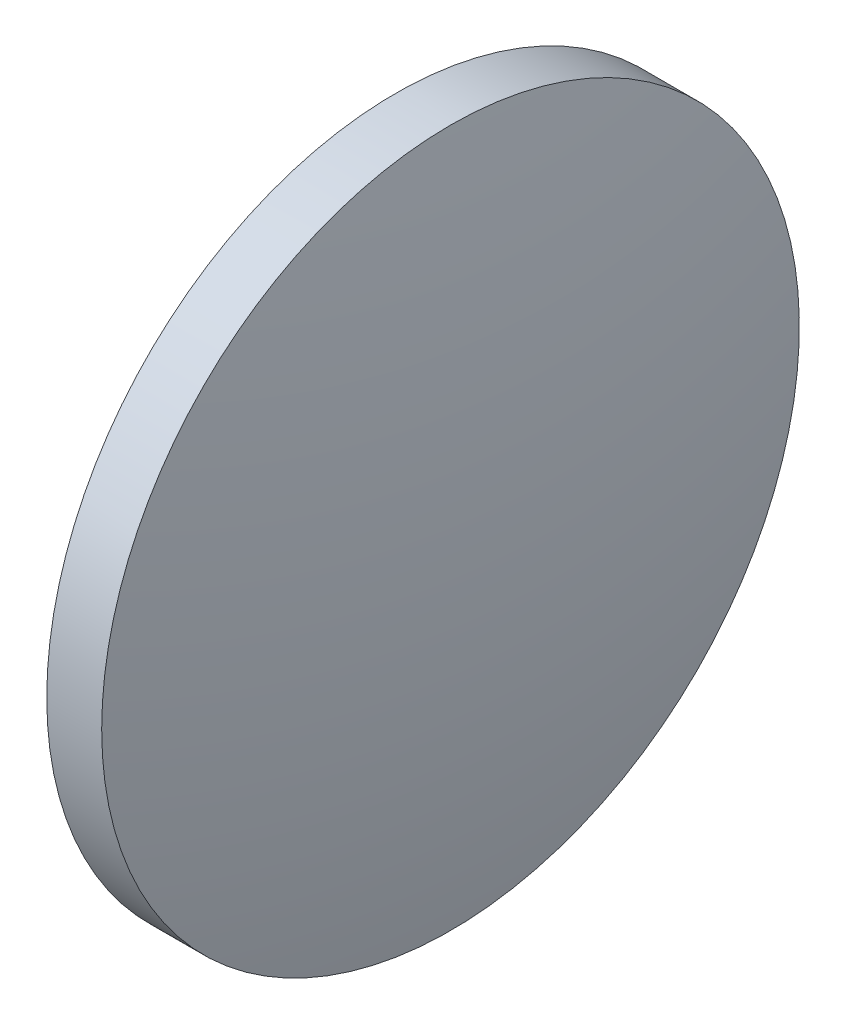
ISO-10303-21;
HEADER;
FILE_DESCRIPTION(('STEP AP214'),'2;1');
FILE_NAME('part.step','',(''),(''),'','','');
FILE_SCHEMA(('AUTOMOTIVE_DESIGN { 1 0 10303 214 1 1 1 1 }'));
ENDSEC;
DATA;
#1=APPLICATION_CONTEXT('core data for automotive mechanical design processes');
#2=APPLICATION_PROTOCOL_DEFINITION('international standard','automotive_design',2000,#1);
#3=PRODUCT_CONTEXT('',#1,'mechanical');
#4=PRODUCT('Part','Part','',(#3));
#5=PRODUCT_RELATED_PRODUCT_CATEGORY('part','',(#4));
#6=PRODUCT_DEFINITION_FORMATION('','',#4);
#7=PRODUCT_DEFINITION_CONTEXT('part definition',#1,'design');
#8=PRODUCT_DEFINITION('design','',#6,#7);
#9=PRODUCT_DEFINITION_SHAPE('','',#8);
#10=(LENGTH_UNIT() NAMED_UNIT(*) SI_UNIT(.MILLI.,.METRE.));
#11=(NAMED_UNIT(*) PLANE_ANGLE_UNIT() SI_UNIT($,.RADIAN.));
#12=(NAMED_UNIT(*) SI_UNIT($,.STERADIAN.) SOLID_ANGLE_UNIT());
#13=UNCERTAINTY_MEASURE_WITH_UNIT(LENGTH_MEASURE(1.E-05),#10,'distance_accuracy_value','');
#14=(GEOMETRIC_REPRESENTATION_CONTEXT(3) GLOBAL_UNCERTAINTY_ASSIGNED_CONTEXT((#13)) GLOBAL_UNIT_ASSIGNED_CONTEXT((#10,
#11,#12)) REPRESENTATION_CONTEXT('',''));
#15=CARTESIAN_POINT('',(0.,0.,0.));
#16=DIRECTION('',(0.,0.,1.));
#17=DIRECTION('',(1.,0.,0.));
#18=AXIS2_PLACEMENT_3D('',#15,#16,#17);
#19=CARTESIAN_POINT('',(330.483433764342,40.4416634295603,0.));
#20=DIRECTION('',(-1.,0.,0.));
#21=DIRECTION('',(0.,1.,0.));
#22=AXIS2_PLACEMENT_3D('',#19,#20,#21);
#23=SPHERICAL_SURFACE('',#22,62.6846153846156);
#24=CARTESIAN_POINT('',(391.868049148957,40.4416634295605,0.));
#25=DIRECTION('',(-1.,0.,0.));
#26=DIRECTION('',(0.,0.,1.));
#27=AXIS2_PLACEMENT_3D('',#24,#25,#26);
#28=CIRCLE('',#27,12.7);
#29=CARTESIAN_POINT('',(391.868049148957,40.4416634295605,12.7));
#30=VERTEX_POINT('',#29);
#31=EDGE_CURVE('E10',#30,#30,#28,.T.);
#32=ORIENTED_EDGE('',*,*,#31,.F.);
#33=EDGE_LOOP('',(#32));
#34=FACE_BOUND('',#33,.T.);
#35=ADVANCED_FACE('F35',(#34),#23,.T.);
#36=CARTESIAN_POINT('',(384.2381530978,40.4416634295605,0.));
#37=DIRECTION('',(-1.,0.,0.));
#38=DIRECTION('',(0.,0.,1.));
#39=AXIS2_PLACEMENT_3D('',#36,#37,#38);
#40=CYLINDRICAL_SURFACE('',#39,12.7);
#41=CARTESIAN_POINT('',(389.868049148957,40.4416634295605,0.));
#42=DIRECTION('',(-1.,0.,0.));
#43=DIRECTION('',(0.,0.,1.));
#44=AXIS2_PLACEMENT_3D('',#41,#42,#43);
#45=CIRCLE('',#44,12.7);
#46=CARTESIAN_POINT('',(389.868049148957,40.4416634295605,12.7));
#47=VERTEX_POINT('',#46);
#48=EDGE_CURVE('E41',#47,#47,#45,.T.);
#49=ORIENTED_EDGE('',*,*,#48,.F.);
#50=EDGE_LOOP('',(#49));
#51=FACE_BOUND('',#50,.T.);
#52=ORIENTED_EDGE('',*,*,#31,.T.);
#53=EDGE_LOOP('',(#52));
#54=FACE_BOUND('',#53,.T.);
#55=ADVANCED_FACE('F49',(#51,#54),#40,.T.);
#56=CARTESIAN_POINT('',(389.868049148957,40.4416634295605,0.));
#57=DIRECTION('',(1.,0.,0.));
#58=DIRECTION('',(0.,0.,-1.));
#59=AXIS2_PLACEMENT_3D('',#56,#57,#58);
#60=PLANE('',#59);
#61=ORIENTED_EDGE('',*,*,#48,.T.);
#62=EDGE_LOOP('',(#61));
#63=FACE_BOUND('',#62,.T.);
#64=ADVANCED_FACE('F47',(#63),#60,.F.);
#65=CLOSED_SHELL('',(#35,#55,#64));
#66=MANIFOLD_SOLID_BREP('B2',#65);
#67=ADVANCED_BREP_SHAPE_REPRESENTATION('',(#18,#66),#14);
#68=SHAPE_DEFINITION_REPRESENTATION(#9,#67);
ENDSEC;
END-ISO-10303-21;
